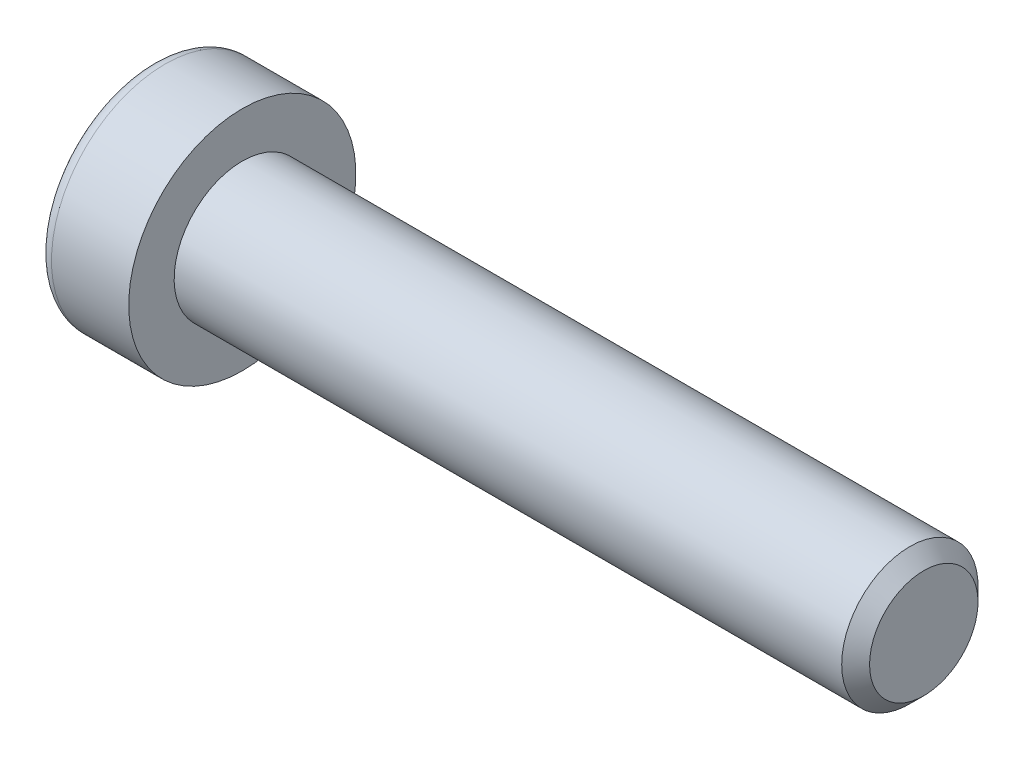
ISO-10303-21;
HEADER;
FILE_DESCRIPTION(('STEP AP214'),'2;1');
FILE_NAME('part.step','',(''),(''),'','','');
FILE_SCHEMA(('AUTOMOTIVE_DESIGN { 1 0 10303 214 1 1 1 1 }'));
ENDSEC;
DATA;
#1=APPLICATION_CONTEXT('core data for automotive mechanical design processes');
#2=APPLICATION_PROTOCOL_DEFINITION('international standard','automotive_design',2000,#1);
#3=PRODUCT_CONTEXT('',#1,'mechanical');
#4=PRODUCT('Part','Part','',(#3));
#5=PRODUCT_RELATED_PRODUCT_CATEGORY('part','',(#4));
#6=PRODUCT_DEFINITION_FORMATION('','',#4);
#7=PRODUCT_DEFINITION_CONTEXT('part definition',#1,'design');
#8=PRODUCT_DEFINITION('design','',#6,#7);
#9=PRODUCT_DEFINITION_SHAPE('','',#8);
#10=(LENGTH_UNIT() NAMED_UNIT(*) SI_UNIT(.MILLI.,.METRE.));
#11=(NAMED_UNIT(*) PLANE_ANGLE_UNIT() SI_UNIT($,.RADIAN.));
#12=(NAMED_UNIT(*) SI_UNIT($,.STERADIAN.) SOLID_ANGLE_UNIT());
#13=UNCERTAINTY_MEASURE_WITH_UNIT(LENGTH_MEASURE(1.E-05),#10,'distance_accuracy_value','');
#14=(GEOMETRIC_REPRESENTATION_CONTEXT(3) GLOBAL_UNCERTAINTY_ASSIGNED_CONTEXT((#13)) GLOBAL_UNIT_ASSIGNED_CONTEXT((#10,
#11,#12)) REPRESENTATION_CONTEXT('',''));
#15=CARTESIAN_POINT('',(0.,0.,0.));
#16=DIRECTION('',(0.,0.,1.));
#17=DIRECTION('',(1.,0.,0.));
#18=AXIS2_PLACEMENT_3D('',#15,#16,#17);
#19=CARTESIAN_POINT('',(-1.00800000126355,0.,0.));
#20=DIRECTION('',(-1.,0.,0.));
#21=DIRECTION('',(0.,0.,1.));
#22=AXIS2_PLACEMENT_3D('',#19,#20,#21);
#23=CONICAL_SURFACE('',#22,2.32325748220319,1.04719754984266);
#24=CARTESIAN_POINT('',(0.333333335333919,-2.27373675443232E-10,0.));
#25=VERTEX_POINT('',#24);
#26=VERTEX_LOOP('',#25);
#27=FACE_BOUND('',#26,.T.);
#28=CARTESIAN_POINT('',(-1.00000000148083,2.00000000033728,1.15470053795177));
#29=CARTESIAN_POINT('',(-0.970695546656412,2.00000000012114,1.05321634683082));
#30=CARTESIAN_POINT('',(-0.944044678609069,2.00000000003247,0.950856145630905));
#31=CARTESIAN_POINT('',(-0.897526388820767,1.99999999996746,0.744363444823034));
#32=CARTESIAN_POINT('',(-0.877675421691299,1.99999999999139,0.640227277433704));
#33=CARTESIAN_POINT('',(-0.84677596021723,2.0000000000084,0.433245449975039));
#34=CARTESIAN_POINT('',(-0.835521788851128,2.00000000000224,0.330431627792259));
#35=CARTESIAN_POINT('',(-0.822089169378264,1.99999999999776,0.124320462818436));
#36=CARTESIAN_POINT('',(-0.819899595232345,1.99999999999944,0.021023868671409));
#37=CARTESIAN_POINT('',(-0.824466291460138,2.00000000000049,-0.17197473600168));
#38=CARTESIAN_POINT('',(-0.830101286547052,2.00000000000013,-0.261705707541263));
#39=CARTESIAN_POINT('',(-0.847957302106096,1.99999999999987,-0.440583082607356));
#40=CARTESIAN_POINT('',(-0.86018441618838,1.99999999999996,-0.529728867906561));
#41=CARTESIAN_POINT('',(-0.890749834828529,2.00000000000004,-0.708974747233866));
#42=CARTESIAN_POINT('',(-0.909217643747823,2.00000000000002,-0.799052166721046));
#43=CARTESIAN_POINT('',(-0.95113176245156,1.99999999999998,-0.977863889550313));
#44=CARTESIAN_POINT('',(-0.974568230407688,1.99999999999996,-1.06660048191016));
#45=CARTESIAN_POINT('',(-1.00000000170015,2.,-1.15470053794658));
#46=B_SPLINE_CURVE_WITH_KNOTS('',3,(#28,#29,#30,#31,#32,#33,#34,#35,#36,#37,#38,#39,#40,#41,#42,
#43,#44,#45),.UNSPECIFIED.,.F.,.F.,(4,2,2,2,2,2,2,2,4),(0.,0.317016011629405,0.634793817184081,
0.944707606355673,1.25424088914081,1.52370778262096,1.79342419353215,2.06912162199251,
2.34427797278028),.UNSPECIFIED.);
#47=CARTESIAN_POINT('',(-1.00000000168466,1.99999999978942,1.15470053825767));
#48=VERTEX_POINT('',#47);
#49=CARTESIAN_POINT('',(-1.00000000175485,2.,-1.15470053813609));
#50=VERTEX_POINT('',#49);
#51=EDGE_CURVE('E19',#48,#50,#46,.T.);
#52=ORIENTED_EDGE('',*,*,#51,.T.);
#53=CARTESIAN_POINT('',(-1.00000000148083,1.99999999979843,-1.15470053888509));
#54=CARTESIAN_POINT('',(-0.970695546656412,1.91211211209711,-1.20544263425837));
#55=CARTESIAN_POINT('',(-0.944044678609069,1.82346557747715,-1.25662273478154));
#56=CARTESIAN_POINT('',(-0.897526388820767,1.64463765284897,-1.35986908512917));
#57=CARTESIAN_POINT('',(-0.877675421691298,1.55445308644903,-1.41193716884456));
#58=CARTESIAN_POINT('',(-0.846775960217229,1.37520156575661,-1.51542808258863));
#59=CARTESIAN_POINT('',(-0.835521788851128,1.28616218388306,-1.56683499367469));
#60=CARTESIAN_POINT('',(-0.822089169378263,1.10766467900989,-1.66989057615772));
#61=CARTESIAN_POINT('',(-0.819899595232344,1.01820720435499,-1.72153887323269));
#62=CARTESIAN_POINT('',(-0.824466291460137,0.851065509813669,-1.81803817557014));
#63=CARTESIAN_POINT('',(-0.830101286547051,0.773356208953953,-1.86290366133962));
#64=CARTESIAN_POINT('',(-0.847957302106095,0.618443857984307,-1.95234234887244));
#65=CARTESIAN_POINT('',(-0.860184416188378,0.541241343274929,-1.99691524152212));
#66=CARTESIAN_POINT('',(-0.890749834828528,0.38600985825384,-2.08653818118584));
#67=CARTESIAN_POINT('',(-0.909217643747822,0.308000524670585,-2.13157689092942));
#68=CARTESIAN_POINT('',(-0.951131762451559,0.153145030205958,-2.22098275234402));
#69=CARTESIAN_POINT('',(-0.974568230407687,0.0762968869770577,-2.26535104852392));
#70=CARTESIAN_POINT('',(-1.00000000170015,3.74707656133815E-10,-2.30940107654216));
#71=B_SPLINE_CURVE_WITH_KNOTS('',3,(#53,#54,#55,#56,#57,#58,#59,#60,#61,#62,#63,#64,#65,#66,#67,
#68,#69,#70),.UNSPECIFIED.,.F.,.F.,(4,2,2,2,2,2,2,2,4),(0.,0.317016011629405,0.63479381718408,
0.944707606355672,1.25424088914081,1.52370778262096,1.79342419353215,2.06912162199251,
2.34427797278029),.UNSPECIFIED.);
#72=CARTESIAN_POINT('',(-1.00000000168466,0.,-2.30940107651534));
#73=VERTEX_POINT('',#72);
#74=EDGE_CURVE('E79',#50,#73,#71,.T.);
#75=ORIENTED_EDGE('',*,*,#74,.T.);
#76=CARTESIAN_POINT('',(-1.00000000148083,-5.38851016182991E-10,-2.30940107683686));
#77=CARTESIAN_POINT('',(-0.970695546656412,-0.0878878880240315,-2.2586589810892));
#78=CARTESIAN_POINT('',(-0.944044678609069,-0.176534422555313,-2.20747888041245));
#79=CARTESIAN_POINT('',(-0.897526388820767,-0.355362347118483,-2.10423252995221));
#80=CARTESIAN_POINT('',(-0.877675421691298,-0.445546913542356,-2.05216444627827));
#81=CARTESIAN_POINT('',(-0.846775960217229,-0.624798434251795,-1.94867353256367));
#82=CARTESIAN_POINT('',(-0.835521788851128,-0.713837816119178,-1.89726662146695));
#83=CARTESIAN_POINT('',(-0.822089169378263,-0.892335320987875,-1.79421103897616));
#84=CARTESIAN_POINT('',(-0.819899595232344,-0.98179279564445,-1.7425627419041));
#85=CARTESIAN_POINT('',(-0.824466291460138,-1.14893449018682,-1.64606343956846));
#86=CARTESIAN_POINT('',(-0.830101286547052,-1.22664379104618,-1.60119795379836));
#87=CARTESIAN_POINT('',(-0.847957302106096,-1.38155614201556,-1.51175926626509));
#88=CARTESIAN_POINT('',(-0.860184416188379,-1.45875865672503,-1.46718637361556));
#89=CARTESIAN_POINT('',(-0.890749834828528,-1.6139901417462,-1.37756343395198));
#90=CARTESIAN_POINT('',(-0.909217643747822,-1.69199947532943,-1.33252472420837));
#91=CARTESIAN_POINT('',(-0.951131762451559,-1.84685496979402,-1.2431188627937));
#92=CARTESIAN_POINT('',(-0.974568230407687,-1.9237031130229,-1.19875056661376));
#93=CARTESIAN_POINT('',(-1.00000000170015,-1.99999999962529,-1.15470053859559));
#94=B_SPLINE_CURVE_WITH_KNOTS('',3,(#76,#77,#78,#79,#80,#81,#82,#83,#84,#85,#86,#87,#88,#89,#90,
#91,#92,#93),.UNSPECIFIED.,.F.,.F.,(4,2,2,2,2,2,2,2,4),(0.,0.317016011629406,0.634793817184081,
0.944707606355673,1.25424088914081,1.52370778262096,1.79342419353215,2.06912162199251,
2.34427797278029),.UNSPECIFIED.);
#95=CARTESIAN_POINT('',(-1.00000000168466,-1.99999999978942,-1.15470053825767));
#96=VERTEX_POINT('',#95);
#97=EDGE_CURVE('E104',#73,#96,#94,.T.);
#98=ORIENTED_EDGE('',*,*,#97,.T.);
#99=CARTESIAN_POINT('',(-1.00000000148083,-2.00000000033728,-1.15470053795177));
#100=CARTESIAN_POINT('',(-0.970695546656412,-2.00000000012114,-1.05321634683083));
#101=CARTESIAN_POINT('',(-0.944044678609069,-2.00000000003247,-0.950856145630907));
#102=CARTESIAN_POINT('',(-0.897526388820767,-1.99999999996746,-0.744363444823035));
#103=CARTESIAN_POINT('',(-0.877675421691298,-1.99999999999138,-0.640227277433706));
#104=CARTESIAN_POINT('',(-0.846775960217229,-2.0000000000084,-0.433245449975041));
#105=CARTESIAN_POINT('',(-0.835521788851128,-2.00000000000224,-0.330431627792261));
#106=CARTESIAN_POINT('',(-0.822089169378263,-1.99999999999776,-0.124320462818438));
#107=CARTESIAN_POINT('',(-0.819899595232344,-1.99999999999944,-0.0210238686714111));
#108=CARTESIAN_POINT('',(-0.824466291460138,-2.00000000000049,0.171974736001678));
#109=CARTESIAN_POINT('',(-0.830101286547052,-2.00000000000013,0.261705707541261));
#110=CARTESIAN_POINT('',(-0.847957302106096,-1.99999999999987,0.440583082607354));
#111=CARTESIAN_POINT('',(-0.860184416188379,-1.99999999999996,0.52972886790656));
#112=CARTESIAN_POINT('',(-0.890749834828528,-2.00000000000004,0.708974747233865));
#113=CARTESIAN_POINT('',(-0.909217643747822,-2.00000000000002,0.799052166721045));
#114=CARTESIAN_POINT('',(-0.951131762451559,-1.99999999999998,0.977863889550313));
#115=CARTESIAN_POINT('',(-0.974568230407687,-1.99999999999996,1.06660048191016));
#116=CARTESIAN_POINT('',(-1.00000000170015,-2.,1.15470053794658));
#117=B_SPLINE_CURVE_WITH_KNOTS('',3,(#99,#100,#101,#102,#103,#104,#105,#106,#107,#108,#109,#110,
#111,#112,#113,#114,#115,#116),.UNSPECIFIED.,.F.,.F.,(4,2,2,2,2,2,2,2,4),(0.,0.317016011629405,
0.63479381718408,0.944707606355672,1.25424088914081,1.52370778262096,1.79342419353215,
2.06912162199251,2.34427797278029),.UNSPECIFIED.);
#118=CARTESIAN_POINT('',(-1.00000000168466,-1.99999999978942,1.15470053825767));
#119=VERTEX_POINT('',#118);
#120=EDGE_CURVE('E128',#96,#119,#117,.T.);
#121=ORIENTED_EDGE('',*,*,#120,.T.);
#122=CARTESIAN_POINT('',(-1.00000000148083,-1.99999999979843,1.15470053888509));
#123=CARTESIAN_POINT('',(-0.970695546656412,-1.91211211209711,1.20544263425837));
#124=CARTESIAN_POINT('',(-0.944044678609069,-1.82346557747715,1.25662273478154));
#125=CARTESIAN_POINT('',(-0.897526388820767,-1.64463765284897,1.35986908512917));
#126=CARTESIAN_POINT('',(-0.877675421691298,-1.55445308644903,1.41193716884456));
#127=CARTESIAN_POINT('',(-0.846775960217229,-1.37520156575661,1.51542808258863));
#128=CARTESIAN_POINT('',(-0.835521788851128,-1.28616218388306,1.56683499367469));
#129=CARTESIAN_POINT('',(-0.822089169378263,-1.10766467900989,1.66989057615772));
#130=CARTESIAN_POINT('',(-0.819899595232344,-1.01820720435499,1.72153887323269));
#131=CARTESIAN_POINT('',(-0.824466291460137,-0.85106550981367,1.81803817557014));
#132=CARTESIAN_POINT('',(-0.830101286547051,-0.773356208953954,1.86290366133962));
#133=CARTESIAN_POINT('',(-0.847957302106095,-0.618443857984308,1.95234234887244));
#134=CARTESIAN_POINT('',(-0.860184416188379,-0.54124134327493,1.99691524152212));
#135=CARTESIAN_POINT('',(-0.890749834828528,-0.386009858253842,2.08653818118584));
#136=CARTESIAN_POINT('',(-0.909217643747822,-0.308000524670587,2.13157689092942));
#137=CARTESIAN_POINT('',(-0.951131762451559,-0.15314503020596,2.22098275234402));
#138=CARTESIAN_POINT('',(-0.974568230407686,-0.0762968869770593,2.26535104852392));
#139=CARTESIAN_POINT('',(-1.00000000170015,-3.74709270888954E-10,2.30940107654216));
#140=B_SPLINE_CURVE_WITH_KNOTS('',3,(#122,#123,#124,#125,#126,#127,#128,#129,#130,#131,#132,
#133,#134,#135,#136,#137,#138,#139),.UNSPECIFIED.,.F.,.F.,(4,2,2,2,2,2,2,2,4),(0.,
0.317016011629405,0.63479381718408,0.944707606355672,1.25424088914081,1.52370778262096,
1.79342419353215,2.06912162199251,2.34427797278028),.UNSPECIFIED.);
#141=CARTESIAN_POINT('',(-1.00000000168466,0.,2.30940107651534));
#142=VERTEX_POINT('',#141);
#143=EDGE_CURVE('E136',#119,#142,#140,.T.);
#144=ORIENTED_EDGE('',*,*,#143,.T.);
#145=CARTESIAN_POINT('',(-1.00000000148083,5.38850869147675E-10,2.30940107683686));
#146=CARTESIAN_POINT('',(-0.970695546656412,0.0878878880240314,2.2586589810892));
#147=CARTESIAN_POINT('',(-0.944044678609069,0.176534422555313,2.20747888041245));
#148=CARTESIAN_POINT('',(-0.897526388820767,0.355362347118483,2.10423252995221));
#149=CARTESIAN_POINT('',(-0.877675421691298,0.445546913542355,2.05216444627827));
#150=CARTESIAN_POINT('',(-0.846775960217229,0.624798434251795,1.94867353256367));
#151=CARTESIAN_POINT('',(-0.835521788851128,0.713837816119178,1.89726662146695));
#152=CARTESIAN_POINT('',(-0.822089169378263,0.892335320987875,1.79421103897616));
#153=CARTESIAN_POINT('',(-0.819899595232344,0.981792795644449,1.7425627419041));
#154=CARTESIAN_POINT('',(-0.824466291460137,1.14893449018682,1.64606343956846));
#155=CARTESIAN_POINT('',(-0.830101286547051,1.22664379104618,1.60119795379836));
#156=CARTESIAN_POINT('',(-0.847957302106095,1.38155614201556,1.51175926626508));
#157=CARTESIAN_POINT('',(-0.860184416188378,1.45875865672503,1.46718637361556));
#158=CARTESIAN_POINT('',(-0.890749834828528,1.6139901417462,1.37756343395198));
#159=CARTESIAN_POINT('',(-0.909217643747822,1.69199947532943,1.33252472420837));
#160=CARTESIAN_POINT('',(-0.951131762451559,1.84685496979402,1.2431188627937));
#161=CARTESIAN_POINT('',(-0.974568230407686,1.9237031130229,1.19875056661376));
#162=CARTESIAN_POINT('',(-1.00000000170015,1.99999999962529,1.15470053859559));
#163=B_SPLINE_CURVE_WITH_KNOTS('',3,(#145,#146,#147,#148,#149,#150,#151,#152,#153,#154,#155,
#156,#157,#158,#159,#160,#161,#162),.UNSPECIFIED.,.F.,.F.,(4,2,2,2,2,2,2,2,4),(0.,
0.317016011629406,0.63479381718408,0.944707606355672,1.25424088914081,1.52370778262096,
1.79342419353215,2.06912162199251,2.34427797278029),.UNSPECIFIED.);
#164=EDGE_CURVE('E81',#142,#48,#163,.T.);
#165=ORIENTED_EDGE('',*,*,#164,.T.);
#166=EDGE_LOOP('',(#52,#75,#98,#121,#144,#165));
#167=FACE_BOUND('',#166,.T.);
#168=ADVANCED_FACE('F15',(#27,#167),#23,.F.);
#169=CARTESIAN_POINT('',(-3.99999999999999,2.,1.15470053837925));
#170=DIRECTION('',(0.,1.,0.));
#171=DIRECTION('',(0.,0.,1.));
#172=AXIS2_PLACEMENT_3D('',#169,#170,#171);
#173=PLANE('',#172);
#174=DIRECTION('',(1.,0.,0.));
#175=VECTOR('',#174,1.);
#176=CARTESIAN_POINT('',(-3.99999999999999,2.,1.15470053837925));
#177=LINE('',#176,#175);
#178=CARTESIAN_POINT('',(-3.99999999999999,2.,1.15470053837925));
#179=VERTEX_POINT('',#178);
#180=EDGE_CURVE('E83',#48,#179,#177,.F.);
#181=ORIENTED_EDGE('',*,*,#180,.T.);
#182=DIRECTION('',(0.,0.,1.));
#183=VECTOR('',#182,1.);
#184=CARTESIAN_POINT('',(-3.99999999999999,2.,0.));
#185=LINE('',#184,#183);
#186=CARTESIAN_POINT('',(-3.99999999999999,2.,-1.15470053837925));
#187=VERTEX_POINT('',#186);
#188=EDGE_CURVE('E88',#187,#179,#185,.T.);
#189=ORIENTED_EDGE('',*,*,#188,.F.);
#190=DIRECTION('',(1.,0.,0.));
#191=VECTOR('',#190,1.);
#192=CARTESIAN_POINT('',(-3.99999999999999,2.,-1.15470053837925));
#193=LINE('',#192,#191);
#194=EDGE_CURVE('E86',#187,#50,#193,.T.);
#195=ORIENTED_EDGE('',*,*,#194,.T.);
#196=ORIENTED_EDGE('',*,*,#51,.F.);
#197=EDGE_LOOP('',(#181,#189,#195,#196));
#198=FACE_BOUND('',#197,.T.);
#199=ADVANCED_FACE('F75',(#198),#173,.F.);
#200=CARTESIAN_POINT('',(-3.99999999999999,0.,2.3094010767585));
#201=DIRECTION('',(0.,0.500000000000001,0.866025403784438));
#202=DIRECTION('',(0.,-0.866025403784438,0.500000000000001));
#203=AXIS2_PLACEMENT_3D('',#200,#201,#202);
#204=PLANE('',#203);
#205=DIRECTION('',(1.,0.,0.));
#206=VECTOR('',#205,1.);
#207=CARTESIAN_POINT('',(-3.99999999999999,0.,2.3094010767585));
#208=LINE('',#207,#206);
#209=CARTESIAN_POINT('',(-3.99999999999999,0.,2.3094010767585));
#210=VERTEX_POINT('',#209);
#211=EDGE_CURVE('E140',#142,#210,#208,.F.);
#212=ORIENTED_EDGE('',*,*,#211,.T.);
#213=DIRECTION('',(0.,-0.866025403784438,0.500000000000001));
#214=VECTOR('',#213,1.);
#215=CARTESIAN_POINT('',(-3.99999999999999,2.,1.15470053837925));
#216=LINE('',#215,#214);
#217=EDGE_CURVE('E94',#179,#210,#216,.T.);
#218=ORIENTED_EDGE('',*,*,#217,.F.);
#219=ORIENTED_EDGE('',*,*,#180,.F.);
#220=ORIENTED_EDGE('',*,*,#164,.F.);
#221=EDGE_LOOP('',(#212,#218,#219,#220));
#222=FACE_BOUND('',#221,.T.);
#223=ADVANCED_FACE('F144',(#222),#204,.F.);
#224=CARTESIAN_POINT('',(-3.99999999999999,-2.,1.15470053837925));
#225=DIRECTION('',(0.,-0.5,0.866025403784439));
#226=DIRECTION('',(0.,-0.866025403784439,-0.5));
#227=AXIS2_PLACEMENT_3D('',#224,#225,#226);
#228=PLANE('',#227);
#229=DIRECTION('',(1.,0.,0.));
#230=VECTOR('',#229,1.);
#231=CARTESIAN_POINT('',(-3.99999999999999,-2.,1.15470053837925));
#232=LINE('',#231,#230);
#233=CARTESIAN_POINT('',(-3.99999999999999,-2.,1.15470053837925));
#234=VERTEX_POINT('',#233);
#235=EDGE_CURVE('E135',#119,#234,#232,.F.);
#236=ORIENTED_EDGE('',*,*,#235,.T.);
#237=DIRECTION('',(0.,-0.866025403784439,-0.5));
#238=VECTOR('',#237,1.);
#239=CARTESIAN_POINT('',(-3.99999999999999,0.,2.3094010767585));
#240=LINE('',#239,#238);
#241=EDGE_CURVE('E223',#210,#234,#240,.T.);
#242=ORIENTED_EDGE('',*,*,#241,.F.);
#243=ORIENTED_EDGE('',*,*,#211,.F.);
#244=ORIENTED_EDGE('',*,*,#143,.F.);
#245=EDGE_LOOP('',(#236,#242,#243,#244));
#246=FACE_BOUND('',#245,.T.);
#247=ADVANCED_FACE('F124',(#246),#228,.F.);
#248=CARTESIAN_POINT('',(-3.99999999999999,-2.,-1.15470053837925));
#249=DIRECTION('',(0.,-1.,0.));
#250=DIRECTION('',(0.,0.,-1.));
#251=AXIS2_PLACEMENT_3D('',#248,#249,#250);
#252=PLANE('',#251);
#253=DIRECTION('',(1.,0.,0.));
#254=VECTOR('',#253,1.);
#255=CARTESIAN_POINT('',(-3.99999999999999,-2.,-1.15470053837925));
#256=LINE('',#255,#254);
#257=CARTESIAN_POINT('',(-3.99999999999999,-2.,-1.15470053837925));
#258=VERTEX_POINT('',#257);
#259=EDGE_CURVE('E134',#96,#258,#256,.F.);
#260=ORIENTED_EDGE('',*,*,#259,.T.);
#261=DIRECTION('',(0.,0.,1.));
#262=VECTOR('',#261,1.);
#263=CARTESIAN_POINT('',(-3.99999999999999,-2.,0.));
#264=LINE('',#263,#262);
#265=EDGE_CURVE('E220',#234,#258,#264,.F.);
#266=ORIENTED_EDGE('',*,*,#265,.F.);
#267=ORIENTED_EDGE('',*,*,#235,.F.);
#268=ORIENTED_EDGE('',*,*,#120,.F.);
#269=EDGE_LOOP('',(#260,#266,#267,#268));
#270=FACE_BOUND('',#269,.T.);
#271=ADVANCED_FACE('F120',(#270),#252,.F.);
#272=CARTESIAN_POINT('',(-3.99999999999999,0.,-2.3094010767585));
#273=DIRECTION('',(0.,-0.5,-0.866025403784438));
#274=DIRECTION('',(0.,0.866025403784438,-0.5));
#275=AXIS2_PLACEMENT_3D('',#272,#273,#274);
#276=PLANE('',#275);
#277=DIRECTION('',(1.,0.,0.));
#278=VECTOR('',#277,1.);
#279=CARTESIAN_POINT('',(-3.99999999999999,0.,-2.3094010767585));
#280=LINE('',#279,#278);
#281=CARTESIAN_POINT('',(-3.99999999999999,0.,-2.3094010767585));
#282=VERTEX_POINT('',#281);
#283=EDGE_CURVE('E37',#73,#282,#280,.F.);
#284=ORIENTED_EDGE('',*,*,#283,.T.);
#285=DIRECTION('',(0.,0.866025403784438,-0.5));
#286=VECTOR('',#285,1.);
#287=CARTESIAN_POINT('',(-3.99999999999999,-2.,-1.15470053837925));
#288=LINE('',#287,#286);
#289=EDGE_CURVE('E217',#258,#282,#288,.T.);
#290=ORIENTED_EDGE('',*,*,#289,.F.);
#291=ORIENTED_EDGE('',*,*,#259,.F.);
#292=ORIENTED_EDGE('',*,*,#97,.F.);
#293=EDGE_LOOP('',(#284,#290,#291,#292));
#294=FACE_BOUND('',#293,.T.);
#295=ADVANCED_FACE('F114',(#294),#276,.F.);
#296=CARTESIAN_POINT('',(-3.99999999999999,2.,-1.15470053837925));
#297=DIRECTION('',(0.,0.5,-0.866025403784439));
#298=DIRECTION('',(0.,0.866025403784439,0.5));
#299=AXIS2_PLACEMENT_3D('',#296,#297,#298);
#300=PLANE('',#299);
#301=ORIENTED_EDGE('',*,*,#194,.F.);
#302=DIRECTION('',(0.,0.866025403784439,0.5));
#303=VECTOR('',#302,1.);
#304=CARTESIAN_POINT('',(-3.99999999999999,0.,-2.3094010767585));
#305=LINE('',#304,#303);
#306=EDGE_CURVE('E215',#282,#187,#305,.T.);
#307=ORIENTED_EDGE('',*,*,#306,.F.);
#308=ORIENTED_EDGE('',*,*,#283,.F.);
#309=ORIENTED_EDGE('',*,*,#74,.F.);
#310=EDGE_LOOP('',(#301,#307,#308,#309));
#311=FACE_BOUND('',#310,.T.);
#312=ADVANCED_FACE('F92',(#311),#300,.F.);
#313=CARTESIAN_POINT('',(-3.99999999999999,3.65470053837925,0.));
#314=DIRECTION('',(-1.,0.,0.));
#315=DIRECTION('',(0.,0.,1.));
#316=AXIS2_PLACEMENT_3D('',#313,#314,#315);
#317=PLANE('',#316);
#318=ORIENTED_EDGE('',*,*,#289,.T.);
#319=ORIENTED_EDGE('',*,*,#306,.T.);
#320=ORIENTED_EDGE('',*,*,#188,.T.);
#321=ORIENTED_EDGE('',*,*,#217,.T.);
#322=ORIENTED_EDGE('',*,*,#241,.T.);
#323=ORIENTED_EDGE('',*,*,#265,.T.);
#324=EDGE_LOOP('',(#318,#319,#320,#321,#322,#323));
#325=FACE_BOUND('',#324,.T.);
#326=CARTESIAN_POINT('',(-3.99999999999999,0.,0.));
#327=DIRECTION('',(1.,0.,0.));
#328=DIRECTION('',(0.,1.,0.));
#329=AXIS2_PLACEMENT_3D('',#326,#327,#328);
#330=CIRCLE('',#329,4.4);
#331=CARTESIAN_POINT('',(-3.99999999999999,4.4,0.));
#332=VERTEX_POINT('',#331);
#333=EDGE_CURVE('E192',#332,#332,#330,.T.);
#334=ORIENTED_EDGE('',*,*,#333,.F.);
#335=EDGE_LOOP('',(#334));
#336=FACE_BOUND('',#335,.T.);
#337=ADVANCED_FACE('F113',(#325,#336),#317,.T.);
#338=CARTESIAN_POINT('',(-3.4,0.,0.));
#339=DIRECTION('',(1.,0.,0.));
#340=DIRECTION('',(0.,0.,-1.));
#341=AXIS2_PLACEMENT_3D('',#338,#339,#340);
#342=TOROIDAL_SURFACE('',#341,4.4,0.6);
#343=CARTESIAN_POINT('',(-3.4,0.,0.));
#344=DIRECTION('',(1.,0.,0.));
#345=DIRECTION('',(0.,1.,0.));
#346=AXIS2_PLACEMENT_3D('',#343,#344,#345);
#347=CIRCLE('',#346,5.);
#348=CARTESIAN_POINT('',(-3.4,5.,0.));
#349=VERTEX_POINT('',#348);
#350=EDGE_CURVE('E233',#349,#349,#347,.T.);
#351=ORIENTED_EDGE('',*,*,#350,.F.);
#352=EDGE_LOOP('',(#351));
#353=FACE_BOUND('',#352,.T.);
#354=ORIENTED_EDGE('',*,*,#333,.T.);
#355=EDGE_LOOP('',(#354));
#356=FACE_BOUND('',#355,.T.);
#357=ADVANCED_FACE('F176',(#353,#356),#342,.T.);
#358=CARTESIAN_POINT('',(-2.,0.,0.));
#359=DIRECTION('',(1.,0.,0.));
#360=DIRECTION('',(0.,1.,0.));
#361=AXIS2_PLACEMENT_3D('',#358,#359,#360);
#362=CYLINDRICAL_SURFACE('',#361,5.);
#363=ORIENTED_EDGE('',*,*,#350,.T.);
#364=EDGE_LOOP('',(#363));
#365=FACE_BOUND('',#364,.T.);
#366=CARTESIAN_POINT('',(0.,0.,0.));
#367=DIRECTION('',(1.,0.,0.));
#368=DIRECTION('',(0.,1.,0.));
#369=AXIS2_PLACEMENT_3D('',#366,#367,#368);
#370=CIRCLE('',#369,5.);
#371=CARTESIAN_POINT('',(0.,5.,0.));
#372=VERTEX_POINT('',#371);
#373=EDGE_CURVE('E102',#372,#372,#370,.T.);
#374=ORIENTED_EDGE('',*,*,#373,.F.);
#375=EDGE_LOOP('',(#374));
#376=FACE_BOUND('',#375,.T.);
#377=ADVANCED_FACE('F173',(#365,#376),#362,.T.);
#378=CARTESIAN_POINT('',(30.,1.5,0.));
#379=DIRECTION('',(1.,0.,0.));
#380=DIRECTION('',(0.,0.,-1.));
#381=AXIS2_PLACEMENT_3D('',#378,#379,#380);
#382=PLANE('',#381);
#383=CARTESIAN_POINT('',(30.0000000003138,0.,0.));
#384=DIRECTION('',(-1.,0.,0.));
#385=DIRECTION('',(0.,0.,1.));
#386=AXIS2_PLACEMENT_3D('',#383,#384,#385);
#387=CIRCLE('',#386,2.38655000026711);
#388=CARTESIAN_POINT('',(30.0000000003138,0.,2.38655000026711));
#389=VERTEX_POINT('',#388);
#390=EDGE_CURVE('E229',#389,#389,#387,.T.);
#391=ORIENTED_EDGE('',*,*,#390,.F.);
#392=EDGE_LOOP('',(#391));
#393=FACE_BOUND('',#392,.T.);
#394=ADVANCED_FACE('F169',(#393),#382,.T.);
#395=CARTESIAN_POINT('',(0.,4.,0.));
#396=DIRECTION('',(1.,0.,0.));
#397=DIRECTION('',(0.,0.,-1.));
#398=AXIS2_PLACEMENT_3D('',#395,#396,#397);
#399=PLANE('',#398);
#400=CARTESIAN_POINT('',(0.,0.,0.));
#401=DIRECTION('',(1.,0.,0.));
#402=DIRECTION('',(0.,1.,0.));
#403=AXIS2_PLACEMENT_3D('',#400,#401,#402);
#404=CIRCLE('',#403,3.);
#405=CARTESIAN_POINT('',(0.,3.,0.));
#406=VERTEX_POINT('',#405);
#407=EDGE_CURVE('E28',#406,#406,#404,.T.);
#408=ORIENTED_EDGE('',*,*,#407,.F.);
#409=EDGE_LOOP('',(#408));
#410=FACE_BOUND('',#409,.T.);
#411=ORIENTED_EDGE('',*,*,#373,.T.);
#412=EDGE_LOOP('',(#411));
#413=FACE_BOUND('',#412,.T.);
#414=ADVANCED_FACE('F162',(#410,#413),#399,.T.);
#415=CARTESIAN_POINT('',(29.3865499996855,0.,0.));
#416=DIRECTION('',(-1.,0.,0.));
#417=DIRECTION('',(0.,0.,1.));
#418=AXIS2_PLACEMENT_3D('',#415,#416,#417);
#419=CONICAL_SURFACE('',#418,2.99999999975853,0.78539816247083);
#420=ORIENTED_EDGE('',*,*,#390,.T.);
#421=EDGE_LOOP('',(#420));
#422=FACE_BOUND('',#421,.T.);
#423=CARTESIAN_POINT('',(29.38655,0.,0.));
#424=DIRECTION('',(1.,0.,0.));
#425=DIRECTION('',(0.,1.,0.));
#426=AXIS2_PLACEMENT_3D('',#423,#424,#425);
#427=CIRCLE('',#426,3.);
#428=CARTESIAN_POINT('',(29.38655,3.,0.));
#429=VERTEX_POINT('',#428);
#430=EDGE_CURVE('E10',#429,#429,#427,.F.);
#431=ORIENTED_EDGE('',*,*,#430,.F.);
#432=EDGE_LOOP('',(#431));
#433=FACE_BOUND('',#432,.T.);
#434=ADVANCED_FACE('F155',(#422,#433),#419,.T.);
#435=CARTESIAN_POINT('',(21.,0.,0.));
#436=DIRECTION('',(1.,0.,0.));
#437=DIRECTION('',(0.,1.,0.));
#438=AXIS2_PLACEMENT_3D('',#435,#436,#437);
#439=CYLINDRICAL_SURFACE('',#438,3.);
#440=ORIENTED_EDGE('',*,*,#430,.T.);
#441=EDGE_LOOP('',(#440));
#442=FACE_BOUND('',#441,.T.);
#443=ORIENTED_EDGE('',*,*,#407,.T.);
#444=EDGE_LOOP('',(#443));
#445=FACE_BOUND('',#444,.T.);
#446=ADVANCED_FACE('F153',(#442,#445),#439,.T.);
#447=CLOSED_SHELL('',(#168,#199,#223,#247,#271,#295,#312,#337,#357,#377,#394,#414,#434,#446));
#448=MANIFOLD_SOLID_BREP('B1',#447);
#449=ADVANCED_BREP_SHAPE_REPRESENTATION('',(#18,#448),#14);
#450=SHAPE_DEFINITION_REPRESENTATION(#9,#449);
ENDSEC;
END-ISO-10303-21;
